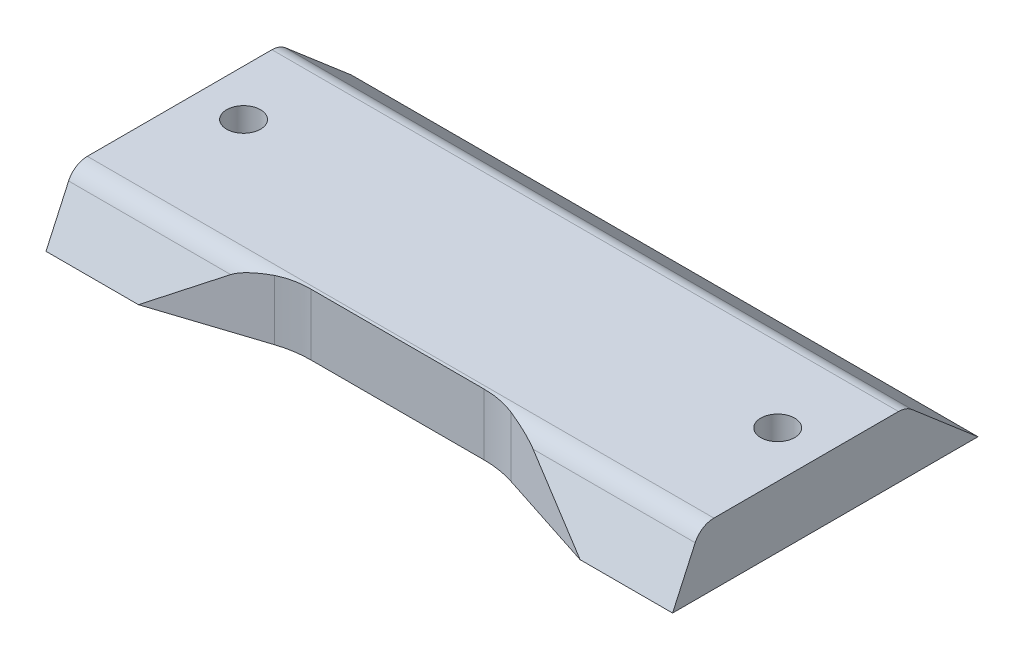
ISO-10303-21;
HEADER;
FILE_DESCRIPTION(('STEP AP214'),'2;1');
FILE_NAME('part.step','',(''),(''),'','','');
FILE_SCHEMA(('AUTOMOTIVE_DESIGN { 1 0 10303 214 1 1 1 1 }'));
ENDSEC;
DATA;
#1=APPLICATION_CONTEXT('core data for automotive mechanical design processes');
#2=APPLICATION_PROTOCOL_DEFINITION('international standard','automotive_design',2000,#1);
#3=PRODUCT_CONTEXT('',#1,'mechanical');
#4=PRODUCT('Part','Part','',(#3));
#5=PRODUCT_RELATED_PRODUCT_CATEGORY('part','',(#4));
#6=PRODUCT_DEFINITION_FORMATION('','',#4);
#7=PRODUCT_DEFINITION_CONTEXT('part definition',#1,'design');
#8=PRODUCT_DEFINITION('design','',#6,#7);
#9=PRODUCT_DEFINITION_SHAPE('','',#8);
#10=(LENGTH_UNIT() NAMED_UNIT(*) SI_UNIT(.MILLI.,.METRE.));
#11=(NAMED_UNIT(*) PLANE_ANGLE_UNIT() SI_UNIT($,.RADIAN.));
#12=(NAMED_UNIT(*) SI_UNIT($,.STERADIAN.) SOLID_ANGLE_UNIT());
#13=UNCERTAINTY_MEASURE_WITH_UNIT(LENGTH_MEASURE(1.E-05),#10,'distance_accuracy_value','');
#14=(GEOMETRIC_REPRESENTATION_CONTEXT(3) GLOBAL_UNCERTAINTY_ASSIGNED_CONTEXT((#13)) GLOBAL_UNIT_ASSIGNED_CONTEXT((#10,
#11,#12)) REPRESENTATION_CONTEXT('',''));
#15=CARTESIAN_POINT('',(0.,0.,0.));
#16=DIRECTION('',(0.,0.,1.));
#17=DIRECTION('',(1.,0.,0.));
#18=AXIS2_PLACEMENT_3D('',#15,#16,#17);
#19=CARTESIAN_POINT('',(30.5,22.5562634239161,49.4965028111011));
#20=DIRECTION('',(0.,-0.414684223638812,-0.909965381025606));
#21=DIRECTION('',(0.,0.909965381025606,-0.414684223638812));
#22=AXIS2_PLACEMENT_3D('',#19,#20,#21);
#23=PLANE('',#22);
#24=DIRECTION('',(0.787334478117857,-0.561017398337229,0.255663642956537));
#25=VECTOR('',#24,1.);
#26=CARTESIAN_POINT('',(42.2520968908348,36.2130349536204,43.2729169282787));
#27=LINE('',#26,#25);
#28=CARTESIAN_POINT('',(14.7224414120744,55.8293684472776,34.3334735218835));
#29=VERTEX_POINT('',#28);
#30=CARTESIAN_POINT('',(21.5,51.,36.5342857142857));
#31=VERTEX_POINT('',#30);
#32=EDGE_CURVE('E260',#29,#31,#27,.T.);
#33=ORIENTED_EDGE('',*,*,#32,.T.);
#34=DIRECTION('',(1.,0.,0.));
#35=VECTOR('',#34,1.);
#36=CARTESIAN_POINT('',(30.5,51.,36.5342857142857));
#37=LINE('',#36,#35);
#38=CARTESIAN_POINT('',(30.5,51.,36.5342857142857));
#39=VERTEX_POINT('',#38);
#40=EDGE_CURVE('E251',#31,#39,#37,.T.);
#41=ORIENTED_EDGE('',*,*,#40,.T.);
#42=DIRECTION('',(0.,-0.909965381025606,0.414684223638812));
#43=VECTOR('',#42,1.);
#44=CARTESIAN_POINT('',(30.5,22.5562634239161,49.4965028111011));
#45=LINE('',#44,#43);
#46=CARTESIAN_POINT('',(30.5,55.8293684472776,34.3334735218835));
#47=VERTEX_POINT('',#46);
#48=EDGE_CURVE('E158',#47,#39,#45,.T.);
#49=ORIENTED_EDGE('',*,*,#48,.F.);
#50=DIRECTION('',(-1.,0.,0.));
#51=VECTOR('',#50,1.);
#52=CARTESIAN_POINT('',(30.5,55.8293684472776,34.3334735218835));
#53=LINE('',#52,#51);
#54=EDGE_CURVE('E186',#47,#29,#53,.T.);
#55=ORIENTED_EDGE('',*,*,#54,.T.);
#56=EDGE_LOOP('',(#33,#41,#49,#55));
#57=FACE_BOUND('',#56,.T.);
#58=ADVANCED_FACE('F47',(#57),#23,.F.);
#59=CARTESIAN_POINT('',(30.5,0.,0.));
#60=DIRECTION('',(1.,0.,0.));
#61=DIRECTION('',(0.,0.,-1.));
#62=AXIS2_PLACEMENT_3D('',#59,#60,#61);
#63=PLANE('',#62);
#64=DIRECTION('',(0.,0.,1.));
#65=VECTOR('',#64,1.);
#66=CARTESIAN_POINT('',(30.5,51.,0.));
#67=LINE('',#66,#65);
#68=CARTESIAN_POINT('',(30.5,51.,6.79999999999999));
#69=VERTEX_POINT('',#68);
#70=EDGE_CURVE('E140',#69,#39,#67,.T.);
#71=ORIENTED_EDGE('',*,*,#70,.F.);
#72=DIRECTION('',(0.,-0.650791373455968,-0.759256602365297));
#73=VECTOR('',#72,1.);
#74=CARTESIAN_POINT('',(30.5,26.04,-22.32));
#75=LINE('',#74,#73);
#76=CARTESIAN_POINT('',(30.5,56.5185132047306,13.238265405519));
#77=VERTEX_POINT('',#76);
#78=EDGE_CURVE('E155',#77,#69,#75,.T.);
#79=ORIENTED_EDGE('',*,*,#78,.F.);
#80=CARTESIAN_POINT('',(30.5,55.,14.539848152431));
#81=DIRECTION('',(1.,0.,0.));
#82=DIRECTION('',(0.,0.,-1.));
#83=AXIS2_PLACEMENT_3D('',#80,#81,#82);
#84=CIRCLE('',#83,2.);
#85=CARTESIAN_POINT('',(30.5,57.,14.539848152431));
#86=VERTEX_POINT('',#85);
#87=EDGE_CURVE('E183',#77,#86,#84,.T.);
#88=ORIENTED_EDGE('',*,*,#87,.T.);
#89=DIRECTION('',(0.,0.,1.));
#90=VECTOR('',#89,1.);
#91=CARTESIAN_POINT('',(30.5,57.,0.));
#92=LINE('',#91,#90);
#93=CARTESIAN_POINT('',(30.5,57.,32.5135427598323));
#94=VERTEX_POINT('',#93);
#95=EDGE_CURVE('E163',#86,#94,#92,.T.);
#96=ORIENTED_EDGE('',*,*,#95,.T.);
#97=CARTESIAN_POINT('',(30.5,55.,32.5135427598323));
#98=DIRECTION('',(1.,0.,0.));
#99=DIRECTION('',(0.,0.,-1.));
#100=AXIS2_PLACEMENT_3D('',#97,#98,#99);
#101=CIRCLE('',#100,2.);
#102=EDGE_CURVE('E181',#94,#47,#101,.T.);
#103=ORIENTED_EDGE('',*,*,#102,.T.);
#104=ORIENTED_EDGE('',*,*,#48,.T.);
#105=EDGE_LOOP('',(#71,#79,#88,#96,#103,#104));
#106=FACE_BOUND('',#105,.T.);
#107=ADVANCED_FACE('F154',(#106),#63,.T.);
#108=CARTESIAN_POINT('',(-30.5,0.,0.));
#109=DIRECTION('',(-1.,0.,0.));
#110=DIRECTION('',(0.,0.,-1.));
#111=AXIS2_PLACEMENT_3D('',#108,#109,#110);
#112=PLANE('',#111);
#113=DIRECTION('',(0.,0.,1.));
#114=VECTOR('',#113,1.);
#115=CARTESIAN_POINT('',(-30.5,51.,0.));
#116=LINE('',#115,#114);
#117=CARTESIAN_POINT('',(-30.5,51.,6.79999999999999));
#118=VERTEX_POINT('',#117);
#119=CARTESIAN_POINT('',(-30.5,51.,36.5342857142857));
#120=VERTEX_POINT('',#119);
#121=EDGE_CURVE('E143',#118,#120,#116,.T.);
#122=ORIENTED_EDGE('',*,*,#121,.T.);
#123=DIRECTION('',(0.,-0.909965381025606,0.414684223638812));
#124=VECTOR('',#123,1.);
#125=CARTESIAN_POINT('',(-30.5,22.5562634239161,49.4965028111011));
#126=LINE('',#125,#124);
#127=CARTESIAN_POINT('',(-30.5,55.8293684472776,34.3334735218835));
#128=VERTEX_POINT('',#127);
#129=EDGE_CURVE('E148',#128,#120,#126,.T.);
#130=ORIENTED_EDGE('',*,*,#129,.F.);
#131=CARTESIAN_POINT('',(-30.5,55.,32.5135427598323));
#132=DIRECTION('',(-1.,0.,0.));
#133=DIRECTION('',(0.,0.,1.));
#134=AXIS2_PLACEMENT_3D('',#131,#132,#133);
#135=CIRCLE('',#134,2.);
#136=CARTESIAN_POINT('',(-30.5,57.,32.5135427598323));
#137=VERTEX_POINT('',#136);
#138=EDGE_CURVE('E176',#128,#137,#135,.T.);
#139=ORIENTED_EDGE('',*,*,#138,.T.);
#140=DIRECTION('',(0.,0.,1.));
#141=VECTOR('',#140,1.);
#142=CARTESIAN_POINT('',(-30.5,57.,0.));
#143=LINE('',#142,#141);
#144=CARTESIAN_POINT('',(-30.5,57.,14.539848152431));
#145=VERTEX_POINT('',#144);
#146=EDGE_CURVE('E269',#145,#137,#143,.T.);
#147=ORIENTED_EDGE('',*,*,#146,.F.);
#148=CARTESIAN_POINT('',(-30.5,55.,14.539848152431));
#149=DIRECTION('',(-1.,0.,0.));
#150=DIRECTION('',(0.,0.,1.));
#151=AXIS2_PLACEMENT_3D('',#148,#149,#150);
#152=CIRCLE('',#151,2.);
#153=CARTESIAN_POINT('',(-30.5,56.5185132047306,13.238265405519));
#154=VERTEX_POINT('',#153);
#155=EDGE_CURVE('E178',#145,#154,#152,.T.);
#156=ORIENTED_EDGE('',*,*,#155,.T.);
#157=DIRECTION('',(0.,-0.650791373455968,-0.759256602365297));
#158=VECTOR('',#157,1.);
#159=CARTESIAN_POINT('',(-30.5,26.04,-22.32));
#160=LINE('',#159,#158);
#161=EDGE_CURVE('E168',#154,#118,#160,.T.);
#162=ORIENTED_EDGE('',*,*,#161,.T.);
#163=EDGE_LOOP('',(#122,#130,#139,#147,#156,#162));
#164=FACE_BOUND('',#163,.T.);
#165=ADVANCED_FACE('F272',(#164),#112,.T.);
#166=CARTESIAN_POINT('',(26.,34.3330952441688,21.8));
#167=DIRECTION('',(0.,1.,0.));
#168=DIRECTION('',(0.,0.,1.));
#169=AXIS2_PLACEMENT_3D('',#166,#167,#168);
#170=CYLINDRICAL_SURFACE('',#169,1.65);
#171=CARTESIAN_POINT('',(26.,51.,21.8));
#172=DIRECTION('',(0.,1.,0.));
#173=DIRECTION('',(0.,0.,1.));
#174=AXIS2_PLACEMENT_3D('',#171,#172,#173);
#175=CIRCLE('',#174,1.65);
#176=CARTESIAN_POINT('',(26.,51.,23.45));
#177=VERTEX_POINT('',#176);
#178=EDGE_CURVE('E255',#177,#177,#175,.F.);
#179=CARTESIAN_POINT('',(26.,57.,21.8));
#180=DIRECTION('',(0.,1.,0.));
#181=DIRECTION('',(0.,0.,1.));
#182=AXIS2_PLACEMENT_3D('',#179,#180,#181);
#183=CIRCLE('',#182,1.65);
#184=CARTESIAN_POINT('',(26.,57.,23.45));
#185=VERTEX_POINT('',#184);
#186=EDGE_CURVE('E149',#185,#185,#183,.T.);
#187=CARTESIAN_POINT('',(26.,51.,23.45));
#188=CARTESIAN_POINT('',(26.,51.0625,23.45));
#189=CARTESIAN_POINT('',(26.,51.125,23.45));
#190=CARTESIAN_POINT('',(26.,51.25,23.45));
#191=CARTESIAN_POINT('',(26.,51.3125,23.45));
#192=CARTESIAN_POINT('',(26.,51.4375,23.45));
#193=CARTESIAN_POINT('',(26.,51.5,23.45));
#194=CARTESIAN_POINT('',(26.,51.625,23.45));
#195=CARTESIAN_POINT('',(26.,51.6875,23.45));
#196=CARTESIAN_POINT('',(26.,51.8125,23.45));
#197=CARTESIAN_POINT('',(26.,51.875,23.45));
#198=CARTESIAN_POINT('',(26.,52.,23.45));
#199=CARTESIAN_POINT('',(26.,52.0625,23.45));
#200=CARTESIAN_POINT('',(26.,52.1875,23.45));
#201=CARTESIAN_POINT('',(26.,52.25,23.45));
#202=CARTESIAN_POINT('',(26.,52.375,23.45));
#203=CARTESIAN_POINT('',(26.,52.4375,23.45));
#204=CARTESIAN_POINT('',(26.,52.5625,23.45));
#205=CARTESIAN_POINT('',(26.,52.625,23.45));
#206=CARTESIAN_POINT('',(26.,52.75,23.45));
#207=CARTESIAN_POINT('',(26.,52.8125,23.45));
#208=CARTESIAN_POINT('',(26.,52.9375,23.45));
#209=CARTESIAN_POINT('',(26.,53.,23.45));
#210=CARTESIAN_POINT('',(26.,53.125,23.45));
#211=CARTESIAN_POINT('',(26.,53.1875,23.45));
#212=CARTESIAN_POINT('',(26.,53.3125,23.45));
#213=CARTESIAN_POINT('',(26.,53.375,23.45));
#214=CARTESIAN_POINT('',(26.,53.5,23.45));
#215=CARTESIAN_POINT('',(26.,53.5625,23.45));
#216=CARTESIAN_POINT('',(26.,53.6875,23.45));
#217=CARTESIAN_POINT('',(26.,53.75,23.45));
#218=CARTESIAN_POINT('',(26.,53.875,23.45));
#219=CARTESIAN_POINT('',(26.,53.9375,23.45));
#220=CARTESIAN_POINT('',(26.,54.0625,23.45));
#221=CARTESIAN_POINT('',(26.,54.125,23.45));
#222=CARTESIAN_POINT('',(26.,54.25,23.45));
#223=CARTESIAN_POINT('',(26.,54.3125,23.45));
#224=CARTESIAN_POINT('',(26.,54.4375,23.45));
#225=CARTESIAN_POINT('',(26.,54.5,23.45));
#226=CARTESIAN_POINT('',(26.,54.625,23.45));
#227=CARTESIAN_POINT('',(26.,54.6875,23.45));
#228=CARTESIAN_POINT('',(26.,54.8125,23.45));
#229=CARTESIAN_POINT('',(26.,54.875,23.45));
#230=CARTESIAN_POINT('',(26.,55.,23.45));
#231=CARTESIAN_POINT('',(26.,55.0625,23.45));
#232=CARTESIAN_POINT('',(26.,55.1875,23.45));
#233=CARTESIAN_POINT('',(26.,55.25,23.45));
#234=CARTESIAN_POINT('',(26.,55.375,23.45));
#235=CARTESIAN_POINT('',(26.,55.4375,23.45));
#236=CARTESIAN_POINT('',(26.,55.5625,23.45));
#237=CARTESIAN_POINT('',(26.,55.625,23.45));
#238=CARTESIAN_POINT('',(26.,55.75,23.45));
#239=CARTESIAN_POINT('',(26.,55.8125,23.45));
#240=CARTESIAN_POINT('',(26.,55.9375,23.45));
#241=CARTESIAN_POINT('',(26.,56.,23.45));
#242=CARTESIAN_POINT('',(26.,56.125,23.45));
#243=CARTESIAN_POINT('',(26.,56.1875,23.45));
#244=CARTESIAN_POINT('',(26.,56.3125,23.45));
#245=CARTESIAN_POINT('',(26.,56.375,23.45));
#246=CARTESIAN_POINT('',(26.,56.5,23.45));
#247=CARTESIAN_POINT('',(26.,56.5625,23.45));
#248=CARTESIAN_POINT('',(26.,56.6875,23.45));
#249=CARTESIAN_POINT('',(26.,56.75,23.45));
#250=CARTESIAN_POINT('',(26.,56.875,23.45));
#251=CARTESIAN_POINT('',(26.,56.9375,23.45));
#252=CARTESIAN_POINT('',(26.,57.,23.45));
#253=B_SPLINE_CURVE_WITH_KNOTS('',3,(#187,#188,#189,#190,#191,#192,#193,#194,#195,#196,#197,
#198,#199,#200,#201,#202,#203,#204,#205,#206,#207,#208,#209,#210,#211,#212,#213,#214,#215,#216,
#217,#218,#219,#220,#221,#222,#223,#224,#225,#226,#227,#228,#229,#230,#231,#232,#233,#234,#235,
#236,#237,#238,#239,#240,#241,#242,#243,#244,#245,#246,#247,#248,#249,#250,#251,#252),
.UNSPECIFIED.,.F.,.F.,(4,2,2,2,2,2,2,2,2,2,2,2,2,2,2,2,2,2,2,2,2,2,2,2,2,2,2,2,2,2,2,2,4),(0.,
0.187499999999993,0.375,0.562499999999994,0.750000000000001,0.937499999999994,1.125,
1.31249999999999,1.5,1.68749999999999,1.87499999999999,2.06249999999999,2.25,2.4375,2.625,
2.8125,3.,3.1875,3.375,3.5625,3.75,3.9375,4.12499999999999,4.3125,4.49999999999999,4.6875,
4.87499999999999,5.0625,5.24999999999999,5.4375,5.62499999999999,5.8125,5.99999999999999),.UNSPECIFIED.);
#254=EDGE_CURVE('BSEAM302',#177,#185,#253,.T.);
#255=ORIENTED_EDGE('',*,*,#178,.T.);
#256=ORIENTED_EDGE('',*,*,#186,.T.);
#257=ORIENTED_EDGE('',*,*,#254,.T.);
#258=ORIENTED_EDGE('',*,*,#254,.F.);
#259=EDGE_LOOP('',(#255,#257,#256,#258));
#260=FACE_BOUND('',#259,.T.);
#261=ADVANCED_FACE('F302',(#260),#170,.F.);
#262=ORIENTED_EDGE('',*,*,#129,.T.);
#263=DIRECTION('',(1.,0.,0.));
#264=VECTOR('',#263,1.);
#265=CARTESIAN_POINT('',(30.5,51.,36.5342857142857));
#266=LINE('',#265,#264);
#267=CARTESIAN_POINT('',(-21.5,51.,36.5342857142857));
#268=VERTEX_POINT('',#267);
#269=EDGE_CURVE('E309',#120,#268,#266,.T.);
#270=ORIENTED_EDGE('',*,*,#269,.T.);
#271=DIRECTION('',(0.787334478117857,0.561017398337229,-0.255663642956537));
#272=VECTOR('',#271,1.);
#273=CARTESIAN_POINT('',(-4.43846648441457,63.1572437262481,30.9940560733241));
#274=LINE('',#273,#272);
#275=CARTESIAN_POINT('',(-14.7224414120744,55.8293684472776,34.3334735218835));
#276=VERTEX_POINT('',#275);
#277=EDGE_CURVE('E242',#268,#276,#274,.T.);
#278=ORIENTED_EDGE('',*,*,#277,.T.);
#279=EDGE_CURVE('E185',#276,#128,#53,.T.);
#280=ORIENTED_EDGE('',*,*,#279,.T.);
#281=EDGE_LOOP('',(#262,#270,#278,#280));
#282=FACE_BOUND('',#281,.T.);
#283=ADVANCED_FACE('F294',(#282),#23,.F.);
#284=CARTESIAN_POINT('',(30.5,26.04,-22.32));
#285=DIRECTION('',(0.,0.759256602365297,-0.650791373455968));
#286=DIRECTION('',(0.,0.650791373455968,0.759256602365297));
#287=AXIS2_PLACEMENT_3D('',#284,#285,#286);
#288=PLANE('',#287);
#289=DIRECTION('',(-1.,0.,0.));
#290=VECTOR('',#289,1.);
#291=CARTESIAN_POINT('',(60.8336075490334,51.,6.8));
#292=LINE('',#291,#290);
#293=EDGE_CURVE('E136',#69,#118,#292,.T.);
#294=ORIENTED_EDGE('',*,*,#293,.T.);
#295=ORIENTED_EDGE('',*,*,#161,.F.);
#296=DIRECTION('',(-1.,0.,0.));
#297=VECTOR('',#296,1.);
#298=CARTESIAN_POINT('',(30.5,56.5185132047306,13.238265405519));
#299=LINE('',#298,#297);
#300=EDGE_CURVE('E162',#154,#77,#299,.F.);
#301=ORIENTED_EDGE('',*,*,#300,.T.);
#302=ORIENTED_EDGE('',*,*,#78,.T.);
#303=EDGE_LOOP('',(#294,#295,#301,#302));
#304=FACE_BOUND('',#303,.T.);
#305=ADVANCED_FACE('F160',(#304),#288,.T.);
#306=CARTESIAN_POINT('',(30.5,57.,0.));
#307=DIRECTION('',(0.,-1.,0.));
#308=DIRECTION('',(0.,0.,-1.));
#309=AXIS2_PLACEMENT_3D('',#306,#307,#308);
#310=PLANE('',#309);
#311=ORIENTED_EDGE('',*,*,#186,.F.);
#312=EDGE_LOOP('',(#311));
#313=FACE_BOUND('',#312,.T.);
#314=CARTESIAN_POINT('',(-26.,57.,21.8));
#315=DIRECTION('',(0.,1.,0.));
#316=DIRECTION('',(0.,0.,-1.));
#317=AXIS2_PLACEMENT_3D('',#314,#315,#316);
#318=CIRCLE('',#317,1.65000000000001);
#319=CARTESIAN_POINT('',(-26.,57.,23.45));
#320=VERTEX_POINT('',#319);
#321=EDGE_CURVE('E262',#320,#320,#318,.T.);
#322=ORIENTED_EDGE('',*,*,#321,.F.);
#323=EDGE_LOOP('',(#322));
#324=FACE_BOUND('',#323,.T.);
#325=ORIENTED_EDGE('',*,*,#95,.F.);
#326=DIRECTION('',(-1.,0.,0.));
#327=VECTOR('',#326,1.);
#328=CARTESIAN_POINT('',(-30.5,57.,14.539848152431));
#329=LINE('',#328,#327);
#330=EDGE_CURVE('E173',#86,#145,#329,.T.);
#331=ORIENTED_EDGE('',*,*,#330,.T.);
#332=ORIENTED_EDGE('',*,*,#146,.T.);
#333=DIRECTION('',(-1.,0.,0.));
#334=VECTOR('',#333,1.);
#335=CARTESIAN_POINT('',(30.5,57.,32.5135427598323));
#336=LINE('',#335,#334);
#337=EDGE_CURVE('E166',#137,#94,#336,.F.);
#338=ORIENTED_EDGE('',*,*,#337,.T.);
#339=EDGE_LOOP('',(#325,#331,#332,#338));
#340=FACE_BOUND('',#339,.T.);
#341=ADVANCED_FACE('F280',(#313,#324,#340),#310,.F.);
#342=CARTESIAN_POINT('',(60.8336075490334,51.,0.));
#343=DIRECTION('',(0.,-1.,0.));
#344=DIRECTION('',(0.,0.,-1.));
#345=AXIS2_PLACEMENT_3D('',#342,#343,#344);
#346=PLANE('',#345);
#347=DIRECTION('',(-0.951112182022423,0.,-0.308845620348655));
#348=VECTOR('',#347,1.);
#349=CARTESIAN_POINT('',(21.5,51.,36.5342857142857));
#350=LINE('',#349,#348);
#351=CARTESIAN_POINT('',(11.5055353279246,51.,33.2888781797757));
#352=VERTEX_POINT('',#351);
#353=EDGE_CURVE('E250',#31,#352,#350,.T.);
#354=ORIENTED_EDGE('',*,*,#353,.T.);
#355=CARTESIAN_POINT('',(8.41707912443803,51.,42.7999999999999));
#356=DIRECTION('',(0.,-1.,0.));
#357=DIRECTION('',(0.,0.,-1.));
#358=AXIS2_PLACEMENT_3D('',#355,#356,#357);
#359=CIRCLE('',#358,10.);
#360=CARTESIAN_POINT('',(8.41707912443803,51.,32.7999999999999));
#361=VERTEX_POINT('',#360);
#362=EDGE_CURVE('E12',#352,#361,#359,.F.);
#363=ORIENTED_EDGE('',*,*,#362,.T.);
#364=DIRECTION('',(-1.,0.,0.));
#365=VECTOR('',#364,1.);
#366=CARTESIAN_POINT('',(-10.,51.,32.7999999999999));
#367=LINE('',#366,#365);
#368=CARTESIAN_POINT('',(-8.41707912443803,51.,32.7999999999999));
#369=VERTEX_POINT('',#368);
#370=EDGE_CURVE('E233',#361,#369,#367,.T.);
#371=ORIENTED_EDGE('',*,*,#370,.T.);
#372=CARTESIAN_POINT('',(-8.41707912443803,51.,42.7999999999999));
#373=DIRECTION('',(0.,-1.,0.));
#374=DIRECTION('',(0.,0.,-1.));
#375=AXIS2_PLACEMENT_3D('',#372,#373,#374);
#376=CIRCLE('',#375,10.);
#377=CARTESIAN_POINT('',(-11.5055353279246,51.,33.2888781797757));
#378=VERTEX_POINT('',#377);
#379=EDGE_CURVE('E212',#369,#378,#376,.F.);
#380=ORIENTED_EDGE('',*,*,#379,.T.);
#381=DIRECTION('',(-0.951112182022423,0.,0.308845620348655));
#382=VECTOR('',#381,1.);
#383=CARTESIAN_POINT('',(-21.5,51.,36.5342857142857));
#384=LINE('',#383,#382);
#385=EDGE_CURVE('E230',#378,#268,#384,.T.);
#386=ORIENTED_EDGE('',*,*,#385,.T.);
#387=ORIENTED_EDGE('',*,*,#269,.F.);
#388=ORIENTED_EDGE('',*,*,#121,.F.);
#389=ORIENTED_EDGE('',*,*,#293,.F.);
#390=ORIENTED_EDGE('',*,*,#70,.T.);
#391=ORIENTED_EDGE('',*,*,#40,.F.);
#392=EDGE_LOOP('',(#354,#363,#371,#380,#386,#387,#388,#389,#390,#391));
#393=FACE_BOUND('',#392,.T.);
#394=CARTESIAN_POINT('',(-26.,51.,21.8));
#395=DIRECTION('',(0.,1.,0.));
#396=DIRECTION('',(0.,0.,1.));
#397=AXIS2_PLACEMENT_3D('',#394,#395,#396);
#398=CIRCLE('',#397,1.65000000000001);
#399=CARTESIAN_POINT('',(-26.,51.,23.45));
#400=VERTEX_POINT('',#399);
#401=EDGE_CURVE('E310',#400,#400,#398,.F.);
#402=ORIENTED_EDGE('',*,*,#401,.F.);
#403=EDGE_LOOP('',(#402));
#404=FACE_BOUND('',#403,.T.);
#405=ORIENTED_EDGE('',*,*,#178,.F.);
#406=EDGE_LOOP('',(#405));
#407=FACE_BOUND('',#406,.T.);
#408=ADVANCED_FACE('F138',(#393,#404,#407),#346,.T.);
#409=CARTESIAN_POINT('',(-26.,34.3330952441688,21.8));
#410=DIRECTION('',(0.,1.,0.));
#411=DIRECTION('',(0.,0.,1.));
#412=AXIS2_PLACEMENT_3D('',#409,#410,#411);
#413=CYLINDRICAL_SURFACE('',#412,1.65000000000001);
#414=CARTESIAN_POINT('',(-26.,51.,23.45));
#415=CARTESIAN_POINT('',(-26.,51.0625,23.45));
#416=CARTESIAN_POINT('',(-26.,51.125,23.45));
#417=CARTESIAN_POINT('',(-26.,51.25,23.45));
#418=CARTESIAN_POINT('',(-26.,51.3125,23.45));
#419=CARTESIAN_POINT('',(-26.,51.4375,23.45));
#420=CARTESIAN_POINT('',(-26.,51.5,23.45));
#421=CARTESIAN_POINT('',(-26.,51.625,23.45));
#422=CARTESIAN_POINT('',(-26.,51.6875,23.45));
#423=CARTESIAN_POINT('',(-26.,51.8125,23.45));
#424=CARTESIAN_POINT('',(-26.,51.875,23.45));
#425=CARTESIAN_POINT('',(-26.,52.,23.45));
#426=CARTESIAN_POINT('',(-26.,52.0625,23.45));
#427=CARTESIAN_POINT('',(-26.,52.1875,23.45));
#428=CARTESIAN_POINT('',(-26.,52.25,23.45));
#429=CARTESIAN_POINT('',(-26.,52.375,23.45));
#430=CARTESIAN_POINT('',(-26.,52.4375,23.45));
#431=CARTESIAN_POINT('',(-26.,52.5625,23.45));
#432=CARTESIAN_POINT('',(-26.,52.625,23.45));
#433=CARTESIAN_POINT('',(-26.,52.75,23.45));
#434=CARTESIAN_POINT('',(-26.,52.8125,23.45));
#435=CARTESIAN_POINT('',(-26.,52.9375,23.45));
#436=CARTESIAN_POINT('',(-26.,53.,23.45));
#437=CARTESIAN_POINT('',(-26.,53.125,23.45));
#438=CARTESIAN_POINT('',(-26.,53.1875,23.45));
#439=CARTESIAN_POINT('',(-26.,53.3125,23.45));
#440=CARTESIAN_POINT('',(-26.,53.375,23.45));
#441=CARTESIAN_POINT('',(-26.,53.5,23.45));
#442=CARTESIAN_POINT('',(-26.,53.5625,23.45));
#443=CARTESIAN_POINT('',(-26.,53.6875,23.45));
#444=CARTESIAN_POINT('',(-26.,53.75,23.45));
#445=CARTESIAN_POINT('',(-26.,53.875,23.45));
#446=CARTESIAN_POINT('',(-26.,53.9375,23.45));
#447=CARTESIAN_POINT('',(-26.,54.0625,23.45));
#448=CARTESIAN_POINT('',(-26.,54.125,23.45));
#449=CARTESIAN_POINT('',(-26.,54.25,23.45));
#450=CARTESIAN_POINT('',(-26.,54.3125,23.45));
#451=CARTESIAN_POINT('',(-26.,54.4375,23.45));
#452=CARTESIAN_POINT('',(-26.,54.5,23.45));
#453=CARTESIAN_POINT('',(-26.,54.625,23.45));
#454=CARTESIAN_POINT('',(-26.,54.6875,23.45));
#455=CARTESIAN_POINT('',(-26.,54.8125,23.45));
#456=CARTESIAN_POINT('',(-26.,54.875,23.45));
#457=CARTESIAN_POINT('',(-26.,55.,23.45));
#458=CARTESIAN_POINT('',(-26.,55.0625,23.45));
#459=CARTESIAN_POINT('',(-26.,55.1875,23.45));
#460=CARTESIAN_POINT('',(-26.,55.25,23.45));
#461=CARTESIAN_POINT('',(-26.,55.375,23.45));
#462=CARTESIAN_POINT('',(-26.,55.4375,23.45));
#463=CARTESIAN_POINT('',(-26.,55.5625,23.45));
#464=CARTESIAN_POINT('',(-26.,55.625,23.45));
#465=CARTESIAN_POINT('',(-26.,55.75,23.45));
#466=CARTESIAN_POINT('',(-26.,55.8125,23.45));
#467=CARTESIAN_POINT('',(-26.,55.9375,23.45));
#468=CARTESIAN_POINT('',(-26.,56.,23.45));
#469=CARTESIAN_POINT('',(-26.,56.125,23.45));
#470=CARTESIAN_POINT('',(-26.,56.1875,23.45));
#471=CARTESIAN_POINT('',(-26.,56.3125,23.45));
#472=CARTESIAN_POINT('',(-26.,56.375,23.45));
#473=CARTESIAN_POINT('',(-26.,56.5,23.45));
#474=CARTESIAN_POINT('',(-26.,56.5625,23.45));
#475=CARTESIAN_POINT('',(-26.,56.6875,23.45));
#476=CARTESIAN_POINT('',(-26.,56.75,23.45));
#477=CARTESIAN_POINT('',(-26.,56.875,23.45));
#478=CARTESIAN_POINT('',(-26.,56.9375,23.45));
#479=CARTESIAN_POINT('',(-26.,57.,23.45));
#480=B_SPLINE_CURVE_WITH_KNOTS('',3,(#414,#415,#416,#417,#418,#419,#420,#421,#422,#423,#424,
#425,#426,#427,#428,#429,#430,#431,#432,#433,#434,#435,#436,#437,#438,#439,#440,#441,#442,#443,
#444,#445,#446,#447,#448,#449,#450,#451,#452,#453,#454,#455,#456,#457,#458,#459,#460,#461,#462,
#463,#464,#465,#466,#467,#468,#469,#470,#471,#472,#473,#474,#475,#476,#477,#478,#479),
.UNSPECIFIED.,.F.,.F.,(4,2,2,2,2,2,2,2,2,2,2,2,2,2,2,2,2,2,2,2,2,2,2,2,2,2,2,2,2,2,2,2,4),(0.,
0.187499999999993,0.375,0.562499999999994,0.750000000000001,0.937499999999994,1.125,
1.31249999999999,1.5,1.68749999999999,1.87499999999999,2.06249999999999,2.25,2.4375,2.625,
2.8125,3.,3.1875,3.375,3.5625,3.75,3.9375,4.12499999999999,4.3125,4.49999999999999,4.6875,
4.87499999999999,5.0625,5.24999999999999,5.4375,5.62499999999999,5.8125,5.99999999999999),.UNSPECIFIED.);
#481=EDGE_CURVE('BSEAM320',#400,#320,#480,.T.);
#482=ORIENTED_EDGE('',*,*,#401,.T.);
#483=ORIENTED_EDGE('',*,*,#321,.T.);
#484=ORIENTED_EDGE('',*,*,#481,.T.);
#485=ORIENTED_EDGE('',*,*,#481,.F.);
#486=EDGE_LOOP('',(#482,#484,#483,#485));
#487=FACE_BOUND('',#486,.T.);
#488=ADVANCED_FACE('F320',(#487),#413,.F.);
#489=CARTESIAN_POINT('',(30.5,55.,14.539848152431));
#490=DIRECTION('',(1.,0.,0.));
#491=DIRECTION('',(0.,0.,-1.));
#492=AXIS2_PLACEMENT_3D('',#489,#490,#491);
#493=CYLINDRICAL_SURFACE('',#492,2.);
#494=ORIENTED_EDGE('',*,*,#87,.F.);
#495=ORIENTED_EDGE('',*,*,#300,.F.);
#496=ORIENTED_EDGE('',*,*,#155,.F.);
#497=ORIENTED_EDGE('',*,*,#330,.F.);
#498=EDGE_LOOP('',(#494,#495,#496,#497));
#499=FACE_BOUND('',#498,.T.);
#500=ADVANCED_FACE('F220',(#499),#493,.T.);
#501=CARTESIAN_POINT('',(30.5,55.,32.5135427598323));
#502=DIRECTION('',(-1.,0.,0.));
#503=DIRECTION('',(0.,0.,1.));
#504=AXIS2_PLACEMENT_3D('',#501,#502,#503);
#505=CYLINDRICAL_SURFACE('',#504,2.);
#506=CARTESIAN_POINT('',(9.11783443636208,55.,32.5135427598323));
#507=DIRECTION('',(0.308845620348655,0.,-0.951112182022423));
#508=DIRECTION('',(-0.951112182022423,0.,-0.308845620348655));
#509=AXIS2_PLACEMENT_3D('',#506,#507,#508);
#510=ELLIPSE('',#509,6.47572725085824,2.);
#511=CARTESIAN_POINT('',(11.5055353279246,56.8435983799573,33.2888781797757));
#512=VERTEX_POINT('',#511);
#513=EDGE_CURVE('E194',#29,#512,#510,.F.);
#514=ORIENTED_EDGE('',*,*,#513,.F.);
#515=ORIENTED_EDGE('',*,*,#54,.F.);
#516=ORIENTED_EDGE('',*,*,#102,.F.);
#517=ORIENTED_EDGE('',*,*,#337,.F.);
#518=ORIENTED_EDGE('',*,*,#138,.F.);
#519=ORIENTED_EDGE('',*,*,#279,.F.);
#520=CARTESIAN_POINT('',(-9.11783443636208,55.,32.5135427598323));
#521=DIRECTION('',(-0.308845620348655,0.,-0.951112182022423));
#522=DIRECTION('',(-0.951112182022423,0.,0.308845620348655));
#523=AXIS2_PLACEMENT_3D('',#520,#521,#522);
#524=ELLIPSE('',#523,6.47572725085824,2.);
#525=CARTESIAN_POINT('',(-11.5055353279246,56.8435983799573,33.2888781797757));
#526=VERTEX_POINT('',#525);
#527=EDGE_CURVE('E189',#526,#276,#524,.F.);
#528=ORIENTED_EDGE('',*,*,#527,.F.);
#529=CARTESIAN_POINT('',(-11.5055353279246,56.8435983799573,33.2888781797757));
#530=CARTESIAN_POINT('',(-11.3814465467572,56.8605045877537,33.2485767776051));
#531=CARTESIAN_POINT('',(-11.2562932586455,56.8749528516977,33.210628400801));
#532=CARTESIAN_POINT('',(-11.0042697704322,56.8998745714489,33.1395889720424));
#533=CARTESIAN_POINT('',(-10.8774002152966,56.9103494796867,33.1064961478944));
#534=CARTESIAN_POINT('',(-10.6231546673121,56.9282140394093,33.0455028466347));
#535=CARTESIAN_POINT('',(-10.4957883779177,56.9356246993589,33.0175677654486));
#536=CARTESIAN_POINT('',(-10.2399424165337,56.9481672927406,32.966680103386));
#537=CARTESIAN_POINT('',(-10.1114626363315,56.953299002107,32.9437280125487));
#538=CARTESIAN_POINT('',(-9.85367749121902,56.9618512967937,32.9028684205815));
#539=CARTESIAN_POINT('',(-9.72437230883945,56.9652722480047,32.8849598411219));
#540=CARTESIAN_POINT('',(-9.46513773079811,56.9708332786838,32.8542164614142));
#541=CARTESIAN_POINT('',(-9.33520835355455,56.9729733957145,32.8413815123771));
#542=CARTESIAN_POINT('',(-9.07401923311752,56.9762967191237,32.8207360174226));
#543=CARTESIAN_POINT('',(-8.94275656177959,56.9774730864977,32.8129614598375));
#544=CARTESIAN_POINT('',(-8.68002200265414,56.9790032160501,32.8025926384649));
#545=CARTESIAN_POINT('',(-8.54855011512365,56.9793569792384,32.7999983683179));
#546=CARTESIAN_POINT('',(-8.41707912443803,56.9793792586454,32.7999999999999));
#547=B_SPLINE_CURVE_WITH_KNOTS('',3,(#529,#530,#531,#532,#533,#534,#535,#536,#537,#538,#539,
#540,#541,#542,#543,#544,#545,#546),.UNSPECIFIED.,.F.,.F.,(4,2,2,2,2,2,2,2,4),(0.,
0.39458546561589,0.789026554127987,1.18071662946599,1.57244520711665,1.9640899674133,
2.35572324151708,2.75011214019824,3.14450055471621),.UNSPECIFIED.);
#548=CARTESIAN_POINT('',(-8.41707912443803,56.9793792586454,32.7999999999999));
#549=VERTEX_POINT('',#548);
#550=EDGE_CURVE('E205',#526,#549,#547,.T.);
#551=ORIENTED_EDGE('',*,*,#550,.T.);
#552=DIRECTION('',(-1.,0.,0.));
#553=VECTOR('',#552,1.);
#554=CARTESIAN_POINT('',(30.5,56.9793792586454,32.7999999999999));
#555=LINE('',#554,#553);
#556=CARTESIAN_POINT('',(8.41707912443803,56.9793792586454,32.7999999999999));
#557=VERTEX_POINT('',#556);
#558=EDGE_CURVE('E191',#557,#549,#555,.T.);
#559=ORIENTED_EDGE('',*,*,#558,.F.);
#560=CARTESIAN_POINT('',(8.41707912443803,56.9793792586454,32.7999999999999));
#561=CARTESIAN_POINT('',(8.54855011512365,56.9793569792384,32.7999983683179));
#562=CARTESIAN_POINT('',(8.68002200265414,56.9790032160501,32.8025926384649));
#563=CARTESIAN_POINT('',(8.94275656177959,56.9774730864977,32.8129614598375));
#564=CARTESIAN_POINT('',(9.07401923311752,56.9762967191237,32.8207360174226));
#565=CARTESIAN_POINT('',(9.33520835355455,56.9729733957145,32.8413815123771));
#566=CARTESIAN_POINT('',(9.46513773079811,56.9708332786838,32.8542164614142));
#567=CARTESIAN_POINT('',(9.72437230883945,56.9652722480047,32.8849598411219));
#568=CARTESIAN_POINT('',(9.85367749121902,56.9618512967937,32.9028684205815));
#569=CARTESIAN_POINT('',(10.1114626363315,56.953299002107,32.9437280125487));
#570=CARTESIAN_POINT('',(10.2399424165337,56.9481672927406,32.966680103386));
#571=CARTESIAN_POINT('',(10.4957883779177,56.9356246993589,33.0175677654486));
#572=CARTESIAN_POINT('',(10.6231546673121,56.9282140394093,33.0455028466347));
#573=CARTESIAN_POINT('',(10.8774002152966,56.9103494796867,33.1064961478944));
#574=CARTESIAN_POINT('',(11.0042697704322,56.8998745714489,33.1395889720424));
#575=CARTESIAN_POINT('',(11.2562932586455,56.8749528516977,33.210628400801));
#576=CARTESIAN_POINT('',(11.3814465467572,56.8605045877537,33.2485767776051));
#577=CARTESIAN_POINT('',(11.5055353279246,56.8435983799573,33.2888781797757));
#578=B_SPLINE_CURVE_WITH_KNOTS('',3,(#560,#561,#562,#563,#564,#565,#566,#567,#568,#569,#570,
#571,#572,#573,#574,#575,#576,#577),.UNSPECIFIED.,.F.,.F.,(4,2,2,2,2,2,2,2,4),(0.,
0.394388414517973,0.78877731319913,1.18041058730291,1.57205534759956,1.96378392525022,
2.35547400058822,2.74991508910032,3.14450055471621),.UNSPECIFIED.);
#579=EDGE_CURVE('E56',#557,#512,#578,.T.);
#580=ORIENTED_EDGE('',*,*,#579,.T.);
#581=EDGE_LOOP('',(#514,#515,#516,#517,#518,#519,#528,#551,#559,#580));
#582=FACE_BOUND('',#581,.T.);
#583=ADVANCED_FACE('F215',(#582),#505,.T.);
#584=CARTESIAN_POINT('',(21.5,7.83815469890203,36.5342857142857));
#585=DIRECTION('',(0.308845620348655,0.,-0.951112182022423));
#586=DIRECTION('',(-0.951112182022423,0.,-0.308845620348655));
#587=AXIS2_PLACEMENT_3D('',#584,#585,#586);
#588=PLANE('',#587);
#589=ORIENTED_EDGE('',*,*,#513,.T.);
#590=DIRECTION('',(0.,1.,0.));
#591=VECTOR('',#590,1.);
#592=CARTESIAN_POINT('',(11.5055353279246,51.,33.2888781797757));
#593=LINE('',#592,#591);
#594=EDGE_CURVE('E63',#512,#352,#593,.F.);
#595=ORIENTED_EDGE('',*,*,#594,.T.);
#596=ORIENTED_EDGE('',*,*,#353,.F.);
#597=ORIENTED_EDGE('',*,*,#32,.F.);
#598=EDGE_LOOP('',(#589,#595,#596,#597));
#599=FACE_BOUND('',#598,.T.);
#600=ADVANCED_FACE('F219',(#599),#588,.F.);
#601=CARTESIAN_POINT('',(-21.5,7.83815469890203,36.5342857142857));
#602=DIRECTION('',(-0.308845620348655,0.,-0.951112182022423));
#603=DIRECTION('',(-0.951112182022423,0.,0.308845620348655));
#604=AXIS2_PLACEMENT_3D('',#601,#602,#603);
#605=PLANE('',#604);
#606=ORIENTED_EDGE('',*,*,#385,.F.);
#607=DIRECTION('',(0.,1.,0.));
#608=VECTOR('',#607,1.);
#609=CARTESIAN_POINT('',(-11.5055353279246,56.9793792586453,33.2888781797757));
#610=LINE('',#609,#608);
#611=EDGE_CURVE('E196',#378,#526,#610,.T.);
#612=ORIENTED_EDGE('',*,*,#611,.T.);
#613=ORIENTED_EDGE('',*,*,#527,.T.);
#614=ORIENTED_EDGE('',*,*,#277,.F.);
#615=EDGE_LOOP('',(#606,#612,#613,#614));
#616=FACE_BOUND('',#615,.T.);
#617=ADVANCED_FACE('F239',(#616),#605,.F.);
#618=CARTESIAN_POINT('',(-10.,7.83815469890203,32.7999999999999));
#619=DIRECTION('',(0.,0.,-1.));
#620=DIRECTION('',(-1.,0.,0.));
#621=AXIS2_PLACEMENT_3D('',#618,#619,#620);
#622=PLANE('',#621);
#623=ORIENTED_EDGE('',*,*,#558,.T.);
#624=DIRECTION('',(0.,1.,0.));
#625=VECTOR('',#624,1.);
#626=CARTESIAN_POINT('',(-8.41707912443803,51.,32.7999999999999));
#627=LINE('',#626,#625);
#628=EDGE_CURVE('E202',#549,#369,#627,.F.);
#629=ORIENTED_EDGE('',*,*,#628,.T.);
#630=ORIENTED_EDGE('',*,*,#370,.F.);
#631=DIRECTION('',(0.,1.,0.));
#632=VECTOR('',#631,1.);
#633=CARTESIAN_POINT('',(8.41707912443803,56.9793792586453,32.7999999999999));
#634=LINE('',#633,#632);
#635=EDGE_CURVE('E199',#361,#557,#634,.T.);
#636=ORIENTED_EDGE('',*,*,#635,.T.);
#637=EDGE_LOOP('',(#623,#629,#630,#636));
#638=FACE_BOUND('',#637,.T.);
#639=ADVANCED_FACE('F246',(#638),#622,.F.);
#640=CARTESIAN_POINT('',(-8.41707912443803,7.83815469890203,42.7999999999999));
#641=DIRECTION('',(0.,-1.,0.));
#642=DIRECTION('',(0.,0.,-1.));
#643=AXIS2_PLACEMENT_3D('',#640,#641,#642);
#644=CYLINDRICAL_SURFACE('',#643,10.);
#645=ORIENTED_EDGE('',*,*,#379,.F.);
#646=ORIENTED_EDGE('',*,*,#628,.F.);
#647=ORIENTED_EDGE('',*,*,#550,.F.);
#648=ORIENTED_EDGE('',*,*,#611,.F.);
#649=EDGE_LOOP('',(#645,#646,#647,#648));
#650=FACE_BOUND('',#649,.T.);
#651=ADVANCED_FACE('F213',(#650),#644,.F.);
#652=CARTESIAN_POINT('',(8.41707912443803,7.83815469890203,42.7999999999999));
#653=DIRECTION('',(0.,-1.,0.));
#654=DIRECTION('',(0.,0.,-1.));
#655=AXIS2_PLACEMENT_3D('',#652,#653,#654);
#656=CYLINDRICAL_SURFACE('',#655,10.);
#657=ORIENTED_EDGE('',*,*,#362,.F.);
#658=ORIENTED_EDGE('',*,*,#594,.F.);
#659=ORIENTED_EDGE('',*,*,#579,.F.);
#660=ORIENTED_EDGE('',*,*,#635,.F.);
#661=EDGE_LOOP('',(#657,#658,#659,#660));
#662=FACE_BOUND('',#661,.T.);
#663=ADVANCED_FACE('F49',(#662),#656,.F.);
#664=CLOSED_SHELL('',(#58,#107,#165,#261,#283,#305,#341,#408,#488,#500,#583,#600,#617,#639,#651,#663));
#665=MANIFOLD_SOLID_BREP('B2',#664);
#666=ADVANCED_BREP_SHAPE_REPRESENTATION('',(#18,#665),#14);
#667=SHAPE_DEFINITION_REPRESENTATION(#9,#666);
ENDSEC;
END-ISO-10303-21;
